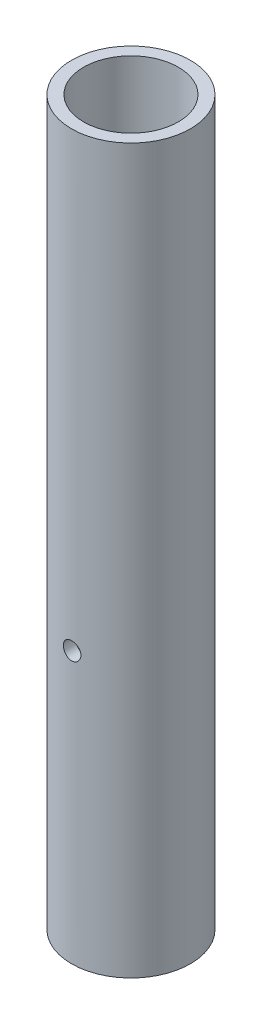
ISO-10303-21;
HEADER;
FILE_DESCRIPTION(('STEP AP214'),'2;1');
FILE_NAME('part.step','',(''),(''),'','','');
FILE_SCHEMA(('AUTOMOTIVE_DESIGN { 1 0 10303 214 1 1 1 1 }'));
ENDSEC;
DATA;
#1=APPLICATION_CONTEXT('core data for automotive mechanical design processes');
#2=APPLICATION_PROTOCOL_DEFINITION('international standard','automotive_design',2000,#1);
#3=PRODUCT_CONTEXT('',#1,'mechanical');
#4=PRODUCT('Part','Part','',(#3));
#5=PRODUCT_RELATED_PRODUCT_CATEGORY('part','',(#4));
#6=PRODUCT_DEFINITION_FORMATION('','',#4);
#7=PRODUCT_DEFINITION_CONTEXT('part definition',#1,'design');
#8=PRODUCT_DEFINITION('design','',#6,#7);
#9=PRODUCT_DEFINITION_SHAPE('','',#8);
#10=(LENGTH_UNIT() NAMED_UNIT(*) SI_UNIT(.MILLI.,.METRE.));
#11=(NAMED_UNIT(*) PLANE_ANGLE_UNIT() SI_UNIT($,.RADIAN.));
#12=(NAMED_UNIT(*) SI_UNIT($,.STERADIAN.) SOLID_ANGLE_UNIT());
#13=UNCERTAINTY_MEASURE_WITH_UNIT(LENGTH_MEASURE(1.E-05),#10,'distance_accuracy_value','');
#14=(GEOMETRIC_REPRESENTATION_CONTEXT(3) GLOBAL_UNCERTAINTY_ASSIGNED_CONTEXT((#13)) GLOBAL_UNIT_ASSIGNED_CONTEXT((#10,
#11,#12)) REPRESENTATION_CONTEXT('',''));
#15=CARTESIAN_POINT('',(0.,0.,0.));
#16=DIRECTION('',(0.,0.,1.));
#17=DIRECTION('',(1.,0.,0.));
#18=AXIS2_PLACEMENT_3D('',#15,#16,#17);
#19=CARTESIAN_POINT('',(0.,203.2,0.));
#20=DIRECTION('',(0.,1.,0.));
#21=DIRECTION('',(0.,0.,1.));
#22=AXIS2_PLACEMENT_3D('',#19,#20,#21);
#23=PLANE('',#22);
#24=CARTESIAN_POINT('',(0.,203.2,0.));
#25=DIRECTION('',(0.,1.,0.));
#26=DIRECTION('',(0.,0.,1.));
#27=AXIS2_PLACEMENT_3D('',#24,#25,#26);
#28=CIRCLE('',#27,16.7005);
#29=CARTESIAN_POINT('',(0.,203.2,16.7005));
#30=VERTEX_POINT('',#29);
#31=EDGE_CURVE('E46',#30,#30,#28,.T.);
#32=ORIENTED_EDGE('',*,*,#31,.T.);
#33=EDGE_LOOP('',(#32));
#34=FACE_BOUND('',#33,.T.);
#35=CARTESIAN_POINT('',(0.,203.2,0.));
#36=DIRECTION('',(0.,1.,0.));
#37=DIRECTION('',(0.,0.,1.));
#38=AXIS2_PLACEMENT_3D('',#35,#36,#37);
#39=CIRCLE('',#38,13.3223);
#40=CARTESIAN_POINT('',(0.,203.2,13.3223));
#41=VERTEX_POINT('',#40);
#42=EDGE_CURVE('E82',#41,#41,#39,.T.);
#43=ORIENTED_EDGE('',*,*,#42,.F.);
#44=EDGE_LOOP('',(#43));
#45=FACE_BOUND('',#44,.T.);
#46=ADVANCED_FACE('F30',(#34,#45),#23,.T.);
#47=CARTESIAN_POINT('',(0.,0.,0.));
#48=DIRECTION('',(0.,1.,0.));
#49=DIRECTION('',(0.,0.,1.));
#50=AXIS2_PLACEMENT_3D('',#47,#48,#49);
#51=PLANE('',#50);
#52=CARTESIAN_POINT('',(0.,0.,0.));
#53=DIRECTION('',(0.,1.,0.));
#54=DIRECTION('',(0.,0.,1.));
#55=AXIS2_PLACEMENT_3D('',#52,#53,#54);
#56=CIRCLE('',#55,16.7005);
#57=CARTESIAN_POINT('',(0.,0.,16.7005));
#58=VERTEX_POINT('',#57);
#59=EDGE_CURVE('E50',#58,#58,#56,.T.);
#60=ORIENTED_EDGE('',*,*,#59,.F.);
#61=EDGE_LOOP('',(#60));
#62=FACE_BOUND('',#61,.T.);
#63=CARTESIAN_POINT('',(0.,0.,0.));
#64=DIRECTION('',(0.,1.,0.));
#65=DIRECTION('',(0.,0.,1.));
#66=AXIS2_PLACEMENT_3D('',#63,#64,#65);
#67=CIRCLE('',#66,13.3223);
#68=CARTESIAN_POINT('',(0.,0.,13.3223));
#69=VERTEX_POINT('',#68);
#70=EDGE_CURVE('E81',#69,#69,#67,.T.);
#71=ORIENTED_EDGE('',*,*,#70,.T.);
#72=EDGE_LOOP('',(#71));
#73=FACE_BOUND('',#72,.T.);
#74=ADVANCED_FACE('F88',(#62,#73),#51,.F.);
#75=CARTESIAN_POINT('',(0.,203.2,0.));
#76=DIRECTION('',(0.,-1.,0.));
#77=DIRECTION('',(0.,0.,-1.));
#78=AXIS2_PLACEMENT_3D('',#75,#76,#77);
#79=CYLINDRICAL_SURFACE('',#78,16.7005);
#80=CARTESIAN_POINT('',(0.,78.65745,-16.7005));
#81=CARTESIAN_POINT('',(-0.137241002586095,78.6574443172632,-16.7004978297723));
#82=CARTESIAN_POINT('',(-0.274562395614258,78.6459144631919,-16.6987905295661));
#83=CARTESIAN_POINT('',(-0.545368954025849,78.6001101597742,-16.692144073684));
#84=CARTESIAN_POINT('',(-0.67885021629541,78.5658133668969,-16.687201743208));
#85=CARTESIAN_POINT('',(-0.938018039695351,78.4755203931146,-16.6746408025099));
#86=CARTESIAN_POINT('',(-1.06371033260249,78.4195403938811,-16.667024188439));
#87=CARTESIAN_POINT('',(-1.30389740425303,78.287509131431,-16.6499569863152));
#88=CARTESIAN_POINT('',(-1.4183937795525,78.2114607357377,-16.640506660328));
#89=CARTESIAN_POINT('',(-1.63382074022937,78.0408410916021,-16.6207438920229));
#90=CARTESIAN_POINT('',(-1.73465481879892,77.9461486019758,-16.6104260745677));
#91=CARTESIAN_POINT('',(-1.91906240748763,77.7411895979179,-16.590133430487));
#92=CARTESIAN_POINT('',(-2.00263493949766,77.6309222015447,-16.5801586233246));
#93=CARTESIAN_POINT('',(-2.15052091577267,77.3972975113157,-16.561629164337));
#94=CARTESIAN_POINT('',(-2.21474133242651,77.2738807317752,-16.5530814577229));
#95=CARTESIAN_POINT('',(-2.32150564940027,77.0178659029884,-16.5384471310881));
#96=CARTESIAN_POINT('',(-2.36405068629374,76.8852683355614,-16.5323603820277));
#97=CARTESIAN_POINT('',(-2.42595757582157,76.615669384149,-16.52338982507));
#98=CARTESIAN_POINT('',(-2.44548439893445,76.4787066534293,-16.520483236049));
#99=CARTESIAN_POINT('',(-2.46131155797085,76.2034199981308,-16.5181328742541));
#100=CARTESIAN_POINT('',(-2.45761317797935,76.0650961492282,-16.518688910037));
#101=CARTESIAN_POINT('',(-2.42722980427084,75.7921771947427,-16.5231801378742));
#102=CARTESIAN_POINT('',(-2.40072829709775,75.6575611543371,-16.5270883556312));
#103=CARTESIAN_POINT('',(-2.32577806296215,75.394707552563,-16.5378014620931));
#104=CARTESIAN_POINT('',(-2.27732873657325,75.2664701655108,-16.5446064299121));
#105=CARTESIAN_POINT('',(-2.15966654400834,75.019454347405,-16.5603761829055));
#106=CARTESIAN_POINT('',(-2.09037571102821,74.9007135919144,-16.5693490528278));
#107=CARTESIAN_POINT('',(-1.93305297324694,74.6764751085356,-16.5884377043361));
#108=CARTESIAN_POINT('',(-1.84501988409833,74.5709782182144,-16.5985535581298));
#109=CARTESIAN_POINT('',(-1.65170319018972,74.3751585159883,-16.6189076510182));
#110=CARTESIAN_POINT('',(-1.54626177954684,74.2849914450624,-16.6291461312805));
#111=CARTESIAN_POINT('',(-1.32166005382029,74.1236095060202,-16.6485014022344));
#112=CARTESIAN_POINT('',(-1.20249968268389,74.0523947153427,-16.6576181883427));
#113=CARTESIAN_POINT('',(-0.95370939895346,73.9309318294017,-16.6737118688301));
#114=CARTESIAN_POINT('',(-0.824073673660535,73.8806954716035,-16.6806875646892));
#115=CARTESIAN_POINT('',(-0.558080419106376,73.8027494217297,-16.6917029860144));
#116=CARTESIAN_POINT('',(-0.421723327610488,73.7750382646293,-16.6957429024199));
#117=CARTESIAN_POINT('',(-0.147502473044598,73.7431356823631,-16.7004063462538));
#118=CARTESIAN_POINT('',(-0.009664134999626,73.7387300929091,-16.7010609811464));
#119=CARTESIAN_POINT('',(0.264783345862588,73.7529956484227,-16.6989646953154));
#120=CARTESIAN_POINT('',(0.401392525136831,73.7716661066641,-16.6962138759356));
#121=CARTESIAN_POINT('',(0.668857209450764,73.8313757006782,-16.687635015049));
#122=CARTESIAN_POINT('',(0.799736445327504,73.8723107697769,-16.6818212937397));
#123=CARTESIAN_POINT('',(1.05277383442949,73.9752780368446,-16.6677665098364));
#124=CARTESIAN_POINT('',(1.1749315912161,74.0373111930986,-16.6595253369887));
#125=CARTESIAN_POINT('',(1.40800196355319,74.1812181108909,-16.6414544710615));
#126=CARTESIAN_POINT('',(1.51882964592307,74.2632280559232,-16.6316140358457));
#127=CARTESIAN_POINT('',(1.72522512469505,74.4445706148625,-16.6114741127572));
#128=CARTESIAN_POINT('',(1.82079206878918,74.5439041956419,-16.6011745992862));
#129=CARTESIAN_POINT('',(1.99473017258971,74.7580265331706,-16.5811790220008));
#130=CARTESIAN_POINT('',(2.07295795995831,74.8729323442112,-16.5714884322264));
#131=CARTESIAN_POINT('',(2.20900133795701,75.1143789935112,-16.5539040271886));
#132=CARTESIAN_POINT('',(2.26681746360813,75.240919526697,-16.5460101648321));
#133=CARTESIAN_POINT('',(2.36017289391032,75.501611777507,-16.5329523514037));
#134=CARTESIAN_POINT('',(2.39578830652267,75.6357357532424,-16.5277790832993));
#135=CARTESIAN_POINT('',(2.44397393140632,75.9081430575069,-16.520723190229));
#136=CARTESIAN_POINT('',(2.45654567008053,76.0464261099238,-16.5188403473072));
#137=CARTESIAN_POINT('',(2.45825178572981,76.3217975487836,-16.5185864139892));
#138=CARTESIAN_POINT('',(2.44761156366051,76.4588845609534,-16.5201815504128));
#139=CARTESIAN_POINT('',(2.40367811516855,76.7292971833747,-16.5266305422418));
#140=CARTESIAN_POINT('',(2.37038491967999,76.8626227987623,-16.5314843931973));
#141=CARTESIAN_POINT('',(2.28216919826038,77.1216695342128,-16.5438922668198));
#142=CARTESIAN_POINT('',(2.22726183282954,77.2473959133437,-16.5514443965317));
#143=CARTESIAN_POINT('',(2.09739874863057,77.4878884088105,-16.5684002872844));
#144=CARTESIAN_POINT('',(2.02244240271702,77.602654182139,-16.5778041062448));
#145=CARTESIAN_POINT('',(1.85378795362931,77.8191138162986,-16.5975126136392));
#146=CARTESIAN_POINT('',(1.75992275602177,77.9206768138982,-16.6078248366426));
#147=CARTESIAN_POINT('',(1.55646806008992,78.1066905461731,-16.628124870636));
#148=CARTESIAN_POINT('',(1.44687490655713,78.1911372919613,-16.6381126055507));
#149=CARTESIAN_POINT('',(1.21439519227234,78.3409183780188,-16.6566984424038));
#150=CARTESIAN_POINT('',(1.09144141773012,78.4061493188647,-16.6652889187958));
#151=CARTESIAN_POINT('',(0.836255925344655,78.5149373896911,-16.6800373518673));
#152=CARTESIAN_POINT('',(0.704034040018824,78.5585171038904,-16.6861978418574));
#153=CARTESIAN_POINT('',(0.476006139049486,78.6128114887158,-16.6939761800684));
#154=CARTESIAN_POINT('',(0.381611705538275,78.6295255386979,-16.6964101284353));
#155=CARTESIAN_POINT('',(0.191491218526871,78.6518467118515,-16.6996727861633));
#156=CARTESIAN_POINT('',(0.0957651806647244,78.6574539653478,-16.7005015143598));
#157=CARTESIAN_POINT('',(0.,78.65745,-16.7005));
#158=B_SPLINE_CURVE_WITH_KNOTS('',3,(#80,#81,#82,#83,#84,#85,#86,#87,#88,#89,#90,#91,#92,#93,
#94,#95,#96,#97,#98,#99,#100,#101,#102,#103,#104,#105,#106,#107,#108,#109,#110,#111,#112,#113,
#114,#115,#116,#117,#118,#119,#120,#121,#122,#123,#124,#125,#126,#127,#128,#129,#130,#131,#132,
#133,#134,#135,#136,#137,#138,#139,#140,#141,#142,#143,#144,#145,#146,#147,#148,#149,#150,#151,
#152,#153,#154,#155,#156,#157),.UNSPECIFIED.,.T.,.F.,(4,2,2,2,2,2,2,2,2,2,2,2,2,2,2,2,2,2,2,2,2,
2,2,2,2,2,2,2,2,2,2,2,2,2,2,2,2,2,4),(0.,0.411373088645843,0.823150497923342,1.2346211975503,
1.64603313495374,2.06021450565259,2.47441933911035,2.89058464983191,3.30672813619844,
3.71987064933668,4.13299032067577,4.54281656225307,4.95265399744673,5.36404409199506,
5.77546019053718,6.19083418843242,6.60620988351655,7.02181767156504,7.43739842658155,
7.84915352273239,8.26089636564904,8.67073102247494,9.08058429666827,9.4933138650361,
9.90606647617899,10.3221142694046,10.7381511565683,11.1527538368046,11.5673290529477,
11.9778964485713,12.3884632835395,12.7987426524888,13.2090348567502,13.6231257305417,
14.0373129961949,14.453689897023,14.8696315618025,15.1566863025583,15.4437376750521),.UNSPECIFIED.);
#159=CARTESIAN_POINT('',(0.,78.65745,-16.7005));
#160=VERTEX_POINT('',#159);
#161=EDGE_CURVE('E10',#160,#160,#158,.T.);
#162=ORIENTED_EDGE('',*,*,#161,.T.);
#163=EDGE_LOOP('',(#162));
#164=FACE_BOUND('',#163,.T.);
#165=CARTESIAN_POINT('',(2.45744999999999,76.2,16.5187057527973));
#166=CARTESIAN_POINT('',(2.45744430947538,76.062768065207,16.5187080124768));
#167=CARTESIAN_POINT('',(2.44591592753167,75.9254557153208,16.5204343683099));
#168=CARTESIAN_POINT('',(2.40011800219898,75.6546679423922,16.5271488430371));
#169=CARTESIAN_POINT('',(2.36582608264375,75.5211964296518,16.5321401712723));
#170=CARTESIAN_POINT('',(2.27554736128846,75.2620492342262,16.5448072932925));
#171=CARTESIAN_POINT('',(2.21957697168816,75.1363677372259,16.5524810558495));
#172=CARTESIAN_POINT('',(2.08756834832131,74.896198799838,16.5696459924043));
#173=CARTESIAN_POINT('',(2.01153295899234,74.7817097759427,16.5791369087479));
#174=CARTESIAN_POINT('',(1.84092653118596,74.5662746998509,16.5989485835532));
#175=CARTESIAN_POINT('',(1.74623133894961,74.4654274393283,16.6092746111797));
#176=CARTESIAN_POINT('',(1.54126137022878,74.280994356058,16.6295459560066));
#177=CARTESIAN_POINT('',(1.43098574802961,74.1974094709287,16.6394912525033));
#178=CARTESIAN_POINT('',(1.19735366640818,74.0495104287176,16.6579355702648));
#179=CARTESIAN_POINT('',(1.07393913659658,73.9852870709957,16.6664276986491));
#180=CARTESIAN_POINT('',(0.8179291910633,73.8785166985645,16.6809505376801));
#181=CARTESIAN_POINT('',(0.685334242953888,73.8359685807299,16.6869813735871));
#182=CARTESIAN_POINT('',(0.415744063703231,73.7740554715486,16.6958649496773));
#183=CARTESIAN_POINT('',(0.278787556374286,73.7545251666068,16.6987403417938));
#184=CARTESIAN_POINT('',(0.0035131420926732,73.7386888867826,16.7010666534024));
#185=CARTESIAN_POINT('',(-0.134804691498321,73.7423816671798,16.700517756431));
#186=CARTESIAN_POINT('',(-0.407747939312379,73.7727560260571,16.6960754624465));
#187=CARTESIAN_POINT('',(-0.542393625632525,73.7992597607219,16.6922079395415));
#188=CARTESIAN_POINT('',(-0.805305363194196,73.874224667994,16.6815917907607));
#189=CARTESIAN_POINT('',(-0.933571255207159,73.9226863883295,16.674843093016));
#190=CARTESIAN_POINT('',(-1.18062220480177,74.0403745452532,16.6591783766539));
#191=CARTESIAN_POINT('',(-1.29937095881405,74.1096761072453,16.6502545393189));
#192=CARTESIAN_POINT('',(-1.52362091941888,74.2670219073512,16.6312345779741));
#193=CARTESIAN_POINT('',(-1.62912128569252,74.3550673333973,16.6211383796819));
#194=CARTESIAN_POINT('',(-1.82492761426419,74.5483929684794,16.6007873388225));
#195=CARTESIAN_POINT('',(-1.91508030907855,74.6538284180485,16.5905318991695));
#196=CARTESIAN_POINT('',(-2.07643605550831,74.8784130284403,16.5711115782907));
#197=CARTESIAN_POINT('',(-2.14763899860403,74.9975622677923,16.5619467033102));
#198=CARTESIAN_POINT('',(-2.26909328064757,75.246349146112,16.5457454089952));
#199=CARTESIAN_POINT('',(-2.31932929421873,75.3759943745708,16.5387105475809));
#200=CARTESIAN_POINT('',(-2.39727176166737,75.6420083425018,16.5275936836832));
#201=CARTESIAN_POINT('',(-2.42497974063722,75.7783766261766,16.5235114813142));
#202=CARTESIAN_POINT('',(-2.45687030013662,76.0526032968459,16.5187998955576));
#203=CARTESIAN_POINT('',(-2.46126995379079,76.1904359116762,16.5181386537319));
#204=CARTESIAN_POINT('',(-2.44699456926314,76.4648705351414,16.5202593161451));
#205=CARTESIAN_POINT('',(-2.42832021918715,76.6014725803515,16.5230411177067));
#206=CARTESIAN_POINT('',(-2.36861086911343,76.8688986443416,16.5317051870516));
#207=CARTESIAN_POINT('',(-2.32768364219478,76.9997472526563,16.5375725068809));
#208=CARTESIAN_POINT('',(-2.22474227600402,77.2527268415027,16.5517342141971));
#209=CARTESIAN_POINT('',(-2.16272713152496,77.3748574061316,16.560028717379));
#210=CARTESIAN_POINT('',(-2.01884727498378,77.6079082578104,16.5781854238803));
#211=CARTESIAN_POINT('',(-1.93684181916694,77.7187407864233,16.5880585642301));
#212=CARTESIAN_POINT('',(-1.75550523252819,77.9251481235191,16.608226984883));
#213=CARTESIAN_POINT('',(-1.65617316005409,78.0207221022022,16.618522288106));
#214=CARTESIAN_POINT('',(-1.44204796963764,78.1946768310527,16.6384743773765));
#215=CARTESIAN_POINT('',(-1.32713748551731,78.2729138713268,16.6481253943565));
#216=CARTESIAN_POINT('',(-1.08567888604736,78.4089734657242,16.6656122849292));
#217=CARTESIAN_POINT('',(-0.959131079345495,78.4667965610742,16.673448206643));
#218=CARTESIAN_POINT('',(-0.698442271417828,78.5601563078468,16.6863966957282));
#219=CARTESIAN_POINT('',(-0.564330106149467,78.5957720819693,16.69151892183));
#220=CARTESIAN_POINT('',(-0.291947825689106,78.6439624266361,16.6985033768461));
#221=CARTESIAN_POINT('',(-0.153677974891229,78.6565384591796,16.7003658126118));
#222=CARTESIAN_POINT('',(0.121699743808391,78.6582576788393,16.7006189038829));
#223=CARTESIAN_POINT('',(0.258806258650909,78.6476209585839,16.6990421681015));
#224=CARTESIAN_POINT('',(0.529258792296391,78.6036876778028,16.6926597123991));
#225=CARTESIAN_POINT('',(0.662604821824158,78.5703911819091,16.6878540016879));
#226=CARTESIAN_POINT('',(0.921694576858051,78.4821605299577,16.6755510463987));
#227=CARTESIAN_POINT('',(1.04744339077209,78.4272410459332,16.6680556271967));
#228=CARTESIAN_POINT('',(1.28797574029564,78.2973467370088,16.6511973429799));
#229=CARTESIAN_POINT('',(1.4027589468411,78.2223713105116,16.6418344219496));
#230=CARTESIAN_POINT('',(1.6192192292109,78.0536951793272,16.6221769146605));
#231=CARTESIAN_POINT('',(1.72076884844073,77.9598317865806,16.6118746915543));
#232=CARTESIAN_POINT('',(1.90675642754568,77.7563862976557,16.5915567784652));
#233=CARTESIAN_POINT('',(1.99119036263164,77.6468005146464,16.5815411563515));
#234=CARTESIAN_POINT('',(2.14095683172924,77.4143274766375,16.5628725648814));
#235=CARTESIAN_POINT('',(2.20618387361259,77.2913716603805,16.5542272372679));
#236=CARTESIAN_POINT('',(2.31496409858167,77.0361819929638,16.5393676407988));
#237=CARTESIAN_POINT('',(2.35853990791791,76.9039579930042,16.5331508355165));
#238=CARTESIAN_POINT('',(2.41282389179991,76.675940402222,16.5252975621668));
#239=CARTESIAN_POINT('',(2.42953326993821,76.5815591153394,16.5228386404219));
#240=CARTESIAN_POINT('',(2.45184824145221,76.3914649245251,16.5195419573083));
#241=CARTESIAN_POINT('',(2.45745397049944,76.2957520368782,16.5187041761315));
#242=CARTESIAN_POINT('',(2.45744999999999,76.2,16.5187057527973));
#243=B_SPLINE_CURVE_WITH_KNOTS('',3,(#165,#166,#167,#168,#169,#170,#171,#172,#173,#174,#175,
#176,#177,#178,#179,#180,#181,#182,#183,#184,#185,#186,#187,#188,#189,#190,#191,#192,#193,#194,
#195,#196,#197,#198,#199,#200,#201,#202,#203,#204,#205,#206,#207,#208,#209,#210,#211,#212,#213,
#214,#215,#216,#217,#218,#219,#220,#221,#222,#223,#224,#225,#226,#227,#228,#229,#230,#231,#232,
#233,#234,#235,#236,#237,#238,#239,#240,#241,#242),.UNSPECIFIED.,.T.,.F.,(4,2,2,2,2,2,2,2,2,2,2,
2,2,2,2,2,2,2,2,2,2,2,2,2,2,2,2,2,2,2,2,2,2,2,2,2,2,2,4),(0.,0.411345843808979,
0.823096633457797,1.2345363048081,1.64591768129818,2.06013471509655,2.47437424147744,
2.89052723468406,3.30665904636239,3.71978363186355,4.13288607473274,4.54279667418323,
4.95271749916048,5.36413412988716,5.77557684278684,6.1909138865837,6.60625330884288,
7.02189578609633,7.43751012303635,7.84924690273879,8.26097140405036,8.67071941399361,
9.08048695831191,9.49322735125619,9.90599018245609,10.3220561597629,10.7381111052526,
11.1526750843307,11.5672127561193,11.977837062485,12.3884601976429,12.798805187989,
13.2091624884052,13.6232185208852,14.0373718068525,14.4537590883261,14.8697103113417,
15.1567257478912,15.4437376774797),.UNSPECIFIED.);
#244=CARTESIAN_POINT('',(2.45744999999999,76.2,16.5187057527973));
#245=VERTEX_POINT('',#244);
#246=EDGE_CURVE('E42',#245,#245,#243,.T.);
#247=ORIENTED_EDGE('',*,*,#246,.T.);
#248=EDGE_LOOP('',(#247));
#249=FACE_BOUND('',#248,.T.);
#250=ORIENTED_EDGE('',*,*,#31,.F.);
#251=EDGE_LOOP('',(#250));
#252=FACE_BOUND('',#251,.T.);
#253=ORIENTED_EDGE('',*,*,#59,.T.);
#254=EDGE_LOOP('',(#253));
#255=FACE_BOUND('',#254,.T.);
#256=ADVANCED_FACE('F32',(#164,#249,#252,#255),#79,.T.);
#257=CARTESIAN_POINT('',(0.,203.2,0.));
#258=DIRECTION('',(0.,-1.,0.));
#259=DIRECTION('',(0.,0.,-1.));
#260=AXIS2_PLACEMENT_3D('',#257,#258,#259);
#261=CYLINDRICAL_SURFACE('',#260,13.3223);
#262=CARTESIAN_POINT('',(0.,78.65745,-13.3223));
#263=CARTESIAN_POINT('',(-0.136792522009882,78.6574447304359,-13.3222975377349));
#264=CARTESIAN_POINT('',(-0.273654074854263,78.6459896909708,-13.3201713519274));
#265=CARTESIAN_POINT('',(-0.543523269970786,78.6005000944315,-13.3118944790324));
#266=CARTESIAN_POINT('',(-0.676527513397432,78.5664462198103,-13.3057403489087));
#267=CARTESIAN_POINT('',(-0.934739924217858,78.4768348697384,-13.2900962878083));
#268=CARTESIAN_POINT('',(-1.05995491682422,78.4212965368099,-13.2806093270526));
#269=CARTESIAN_POINT('',(-1.29927721137958,78.2903465113233,-13.2593366586175));
#270=CARTESIAN_POINT('',(-1.41338546747174,78.2149365279403,-13.2475511486605));
#271=CARTESIAN_POINT('',(-1.62859191929645,78.0454543292284,-13.2228301171818));
#272=CARTESIAN_POINT('',(-1.72954253393135,77.9511962557931,-13.2098839141125));
#273=CARTESIAN_POINT('',(-1.91429164872613,77.7470933705943,-13.1843802662761));
#274=CARTESIAN_POINT('',(-1.99808894068115,77.6372474618142,-13.1718228489462));
#275=CARTESIAN_POINT('',(-2.14676315326968,77.4040484684567,-13.1484148194987));
#276=CARTESIAN_POINT('',(-2.2114905825346,77.2805985723093,-13.1375779849045));
#277=CARTESIAN_POINT('',(-2.31923087025164,77.0243437176195,-13.1189882853121));
#278=CARTESIAN_POINT('',(-2.36224553843881,76.891539539798,-13.1112351633011));
#279=CARTESIAN_POINT('',(-2.42486693858493,76.6219228896804,-13.0997980706226));
#280=CARTESIAN_POINT('',(-2.44473066383543,76.4851720377525,-13.0960694597995));
#281=CARTESIAN_POINT('',(-2.46128387949823,76.2102316033228,-13.0929689058861));
#282=CARTESIAN_POINT('',(-2.45797538053602,76.0720421466858,-13.093596584806));
#283=CARTESIAN_POINT('',(-2.42848659548994,75.8000048691329,-13.0990970298634));
#284=CARTESIAN_POINT('',(-2.40259799561372,75.6661241734761,-13.1039156557702));
#285=CARTESIAN_POINT('',(-2.32914300738034,75.4046395455028,-13.1171700630236));
#286=CARTESIAN_POINT('',(-2.28157572476229,75.2770358723585,-13.1256059935857));
#287=CARTESIAN_POINT('',(-2.16582678284663,75.030871016552,-13.1452013789581));
#288=CARTESIAN_POINT('',(-2.09752683543276,74.9123667433671,-13.156376388944));
#289=CARTESIAN_POINT('',(-1.94233505428968,74.6883908729295,-13.1801804300322));
#290=CARTESIAN_POINT('',(-1.85544139242514,74.5829205587862,-13.1928096040516));
#291=CARTESIAN_POINT('',(-1.66395358936182,74.3863207474694,-13.2183351950785));
#292=CARTESIAN_POINT('',(-1.55910983866294,74.2954343425107,-13.2312327513666));
#293=CARTESIAN_POINT('',(-1.33553458988714,74.1325037694684,-13.2556648170149));
#294=CARTESIAN_POINT('',(-1.21680296094366,74.060459778959,-13.2671993135288));
#295=CARTESIAN_POINT('',(-0.968572564077005,73.9372253930183,-13.2876277985242));
#296=CARTESIAN_POINT('',(-0.83906126003754,73.8860596975536,-13.2965186561086));
#297=CARTESIAN_POINT('',(-0.573081830372026,73.8062769857724,-13.3106337856521));
#298=CARTESIAN_POINT('',(-0.436614421174321,73.7776576523202,-13.3158584343888));
#299=CARTESIAN_POINT('',(-0.162688578237056,73.7441170720116,-13.3220008827736));
#300=CARTESIAN_POINT('',(-0.0252722522780297,73.7388626550834,-13.3229792273783));
#301=CARTESIAN_POINT('',(0.248475681139137,73.7513081992646,-13.3206858618975));
#302=CARTESIAN_POINT('',(0.384807339800255,73.7690070702909,-13.3174143536432));
#303=CARTESIAN_POINT('',(0.651463440249678,73.826579760905,-13.3070265389115));
#304=CARTESIAN_POINT('',(0.781825394658761,73.8662855518791,-13.2999393775406));
#305=CARTESIAN_POINT('',(1.03404211300809,73.9665635632657,-13.282711625697));
#306=CARTESIAN_POINT('',(1.1558963133024,74.0271371646137,-13.2725708331546));
#307=CARTESIAN_POINT('',(1.3890643002495,74.1681726489983,-13.2502096870459));
#308=CARTESIAN_POINT('',(1.50025248026736,74.2488388064061,-13.2379684030302));
#309=CARTESIAN_POINT('',(1.70763362816101,74.4274924749874,-13.2128194091537));
#310=CARTESIAN_POINT('',(1.80382524244045,74.525481548033,-13.1999116392754));
#311=CARTESIAN_POINT('',(1.97974401645314,74.7375057509814,-13.1746843694326));
#312=CARTESIAN_POINT('',(2.0592441416751,74.851730594448,-13.1623745398384));
#313=CARTESIAN_POINT('',(2.19792862091012,75.0921093782575,-13.1399293373154));
#314=CARTESIAN_POINT('',(2.25711371467014,75.2182628840192,-13.1297938852144));
#315=CARTESIAN_POINT('',(2.35316347696199,75.4783326760362,-13.1129204041514));
#316=CARTESIAN_POINT('',(2.39013356615,75.6122089402717,-13.1061663547498));
#317=CARTESIAN_POINT('',(2.44103008978801,75.8844086708485,-13.0967832300155));
#318=CARTESIAN_POINT('',(2.45495903112932,76.0227316517147,-13.0941537059335));
#319=CARTESIAN_POINT('',(2.45929609540872,76.2976253300505,-13.0933396029172));
#320=CARTESIAN_POINT('',(2.45006221429093,76.4341903078455,-13.09508736955));
#321=CARTESIAN_POINT('',(2.40911804692803,76.7037861138592,-13.1026811688482));
#322=CARTESIAN_POINT('',(2.37740788482668,76.8368169615937,-13.1085271788775));
#323=CARTESIAN_POINT('',(2.29256026272494,77.0953839252639,-13.1236306950268));
#324=CARTESIAN_POINT('',(2.23946036205797,77.220932737971,-13.1328822187898));
#325=CARTESIAN_POINT('',(2.11337932854215,77.4613969135937,-13.1537587953946));
#326=CARTESIAN_POINT('',(2.04039685378231,77.5763115580886,-13.1653840084278));
#327=CARTESIAN_POINT('',(1.8753726950871,77.7940410659864,-13.1899087974182));
#328=CARTESIAN_POINT('',(1.78307002340381,77.8966563456413,-13.2028244059864));
#329=CARTESIAN_POINT('',(1.58257089731807,78.0850615666474,-13.2283535916587));
#330=CARTESIAN_POINT('',(1.47437079548734,78.1708476362112,-13.2409670986756));
#331=CARTESIAN_POINT('',(1.24402519334731,78.3238521994475,-13.2645989806582));
#332=CARTESIAN_POINT('',(1.12176689918823,78.3909032296815,-13.2756025746004));
#333=CARTESIAN_POINT('',(0.867558609674203,78.5034071828407,-13.2946306443154));
#334=CARTESIAN_POINT('',(0.735617939974556,78.5488805811971,-13.3026579427642));
#335=CARTESIAN_POINT('',(0.502724509325839,78.6076071792298,-13.3131746315743));
#336=CARTESIAN_POINT('',(0.403141016174936,78.6262666060967,-13.3165774792792));
#337=CARTESIAN_POINT('',(0.202384253078359,78.6511898169094,-13.3211410474375));
#338=CARTESIAN_POINT('',(0.101211021414482,78.6574538988824,-13.3223018217982));
#339=CARTESIAN_POINT('',(0.,78.65745,-13.3223));
#340=B_SPLINE_CURVE_WITH_KNOTS('',3,(#262,#263,#264,#265,#266,#267,#268,#269,#270,#271,#272,
#273,#274,#275,#276,#277,#278,#279,#280,#281,#282,#283,#284,#285,#286,#287,#288,#289,#290,#291,
#292,#293,#294,#295,#296,#297,#298,#299,#300,#301,#302,#303,#304,#305,#306,#307,#308,#309,#310,
#311,#312,#313,#314,#315,#316,#317,#318,#319,#320,#321,#322,#323,#324,#325,#326,#327,#328,#329,
#330,#331,#332,#333,#334,#335,#336,#337,#338,#339),.UNSPECIFIED.,.T.,.F.,(4,2,2,2,2,2,2,2,2,2,2,
2,2,2,2,2,2,2,2,2,2,2,2,2,2,2,2,2,2,2,2,2,2,2,2,2,2,2,4),(0.,0.410007458868857,
0.820365845476644,1.23035944426705,1.64031779071352,2.05453795894284,2.46878729299367,
2.88620248687048,3.30358288389685,3.71628452615578,4.12895035924296,4.53636309638743,
4.94379264111481,5.35359187539376,5.76343141969065,6.17951789638134,6.59560829420312,
7.01218952848594,7.42872794427674,7.83930731552823,8.24986718851456,8.65733467283295,
9.06482912665294,9.47664881837824,9.8885056596298,10.3056457880137,10.7227707251396,
11.1379002460378,11.552984597613,11.9616932099957,12.3703995649663,12.7783913584128,
13.1864106947902,13.6003456801166,14.0143757853872,14.4319962358739,14.8492196018206,
15.152586122628,15.4559453493603),.UNSPECIFIED.);
#341=CARTESIAN_POINT('',(0.,78.65745,-13.3223));
#342=VERTEX_POINT('',#341);
#343=EDGE_CURVE('E75',#342,#342,#340,.T.);
#344=ORIENTED_EDGE('',*,*,#343,.F.);
#345=EDGE_LOOP('',(#344));
#346=FACE_BOUND('',#345,.T.);
#347=CARTESIAN_POINT('',(2.45744999999999,76.2,13.0936861420877));
#348=CARTESIAN_POINT('',(2.45744471252434,76.0632297960912,13.0936887672546));
#349=CARTESIAN_POINT('',(2.44599328427187,75.9263905107073,13.0958523573145));
#350=CARTESIAN_POINT('',(2.40051933167719,75.6565675583931,13.1042626154936));
#351=CARTESIAN_POINT('',(2.3664774055196,75.5235873083454,13.1105127933047));
#352=CARTESIAN_POINT('',(2.2769009910449,75.26542569627,13.1263648077343));
#353=CARTESIAN_POINT('',(2.22138620773851,75.1402373058031,13.1359635706647));
#354=CARTESIAN_POINT('',(2.09049168504527,74.9009598098935,13.157427580033));
#355=CARTESIAN_POINT('',(2.01511359976581,74.7868697813225,13.1692926377235));
#356=CARTESIAN_POINT('',(1.84566401533298,74.5716436824169,13.1941120318759));
#357=CARTESIAN_POINT('',(1.75139950037932,74.4706607491408,13.2070767446556));
#358=CARTESIAN_POINT('',(1.54727004057183,74.2858489915344,13.2325429278505));
#359=CARTESIAN_POINT('',(1.43740408801612,74.2020212761195,13.2450443682769));
#360=CARTESIAN_POINT('',(1.20418660724734,74.053314492177,13.2682863953551));
#361=CARTESIAN_POINT('',(1.08074171485452,73.9885795315988,13.2790133348074));
#362=CARTESIAN_POINT('',(0.824497697193044,73.8808239521103,13.2973816793837));
#363=CARTESIAN_POINT('',(0.691699317198732,73.8378016053911,13.3050233300139));
#364=CARTESIAN_POINT('',(0.422104225575674,73.775165270204,13.3162868055684));
#365=CARTESIAN_POINT('',(0.285369345318011,73.755293245118,13.3199529099806));
#366=CARTESIAN_POINT('',(0.0104604652401703,73.7387178908815,13.3230047690107));
#367=CARTESIAN_POINT('',(-0.127713414869855,73.7420126496225,13.3223908768851));
#368=CARTESIAN_POINT('',(-0.399809270845894,73.7714789307684,13.3169865833624));
#369=CARTESIAN_POINT('',(-0.533762485518052,73.7973726342147,13.3122469039601));
#370=CARTESIAN_POINT('',(-0.795389484029507,73.870862678905,13.2991804197451));
#371=CARTESIAN_POINT('',(-0.923063044322689,73.9184597921389,13.2908534873346));
#372=CARTESIAN_POINT('',(-1.1693155013742,74.0342719900243,13.2714630873877));
#373=CARTESIAN_POINT('',(-1.28784071433236,74.1025986527795,13.2603848709384));
#374=CARTESIAN_POINT('',(-1.51184729011758,74.2578482669273,13.2367179187401));
#375=CARTESIAN_POINT('',(-1.61732736591805,74.344773050895,13.2241290341905));
#376=CARTESIAN_POINT('',(-1.81389485837104,74.5362839135592,13.1986154467347));
#377=CARTESIAN_POINT('',(-1.90474537324406,74.6411130162198,13.1856885328632));
#378=CARTESIAN_POINT('',(-2.06761037583714,74.8646458375138,13.1611347856149));
#379=CARTESIAN_POINT('',(-2.13962460516659,74.9833497464455,13.1495079700736));
#380=CARTESIAN_POINT('',(-2.26283712317003,75.2315706712845,13.128867930336));
#381=CARTESIAN_POINT('',(-2.31400189002775,75.3611047001215,13.1198589216751));
#382=CARTESIAN_POINT('',(-2.39377587592734,75.6271338053473,13.1055397922776));
#383=CARTESIAN_POINT('',(-2.4223875622629,75.7636281185452,13.1002292669365));
#384=CARTESIAN_POINT('',(-2.45589920708583,76.03756950657,13.0939881733707));
#385=CARTESIAN_POINT('',(-2.4611391154879,76.174973606694,13.0929948160711));
#386=CARTESIAN_POINT('',(-2.44866892085441,76.4486936828675,13.0953326269195));
#387=CARTESIAN_POINT('',(-2.43095991434569,76.5850097105934,13.0986635884464));
#388=CARTESIAN_POINT('',(-2.37338612322502,76.8515723144871,13.1092163062837));
#389=CARTESIAN_POINT('',(-2.33369875898547,76.9818585555655,13.1164068916561));
#390=CARTESIAN_POINT('',(-2.23348274720015,77.2339319334627,13.1338419123215));
#391=CARTESIAN_POINT('',(-2.1729526068234,77.3557184607511,13.1440865663503));
#392=CARTESIAN_POINT('',(-2.03198381992083,77.5888353237273,13.1666188406392));
#393=CARTESIAN_POINT('',(-1.95132994822475,77.7000333848662,13.1789280416655));
#394=CARTESIAN_POINT('',(-1.77269417475255,77.9074401289782,13.2041414063031));
#395=CARTESIAN_POINT('',(-1.67471076727976,78.0036475081014,13.2170456215408));
#396=CARTESIAN_POINT('',(-1.46268083746193,78.179607568402,13.2421963248911));
#397=CARTESIAN_POINT('',(-1.34844335980591,78.2591319089785,13.2544321775262));
#398=CARTESIAN_POINT('',(-1.10803215252847,78.3978588201037,13.2766898723325));
#399=CARTESIAN_POINT('',(-0.981858872190086,78.4570621551802,13.2867117977921));
#400=CARTESIAN_POINT('',(-0.721795772523839,78.5531225904554,13.3033666265844));
#401=CARTESIAN_POINT('',(-0.587948932453073,78.5900929446892,13.3100166784446));
#402=CARTESIAN_POINT('',(-0.315811841761479,78.6409999413843,13.3192515358214));
#403=CARTESIAN_POINT('',(-0.177522044443162,78.6549389261117,13.3218367547259));
#404=CARTESIAN_POINT('',(0.0973835159910762,78.6593081132212,13.3226428054376));
#405=CARTESIAN_POINT('',(0.233993724237446,78.6500835698658,13.3209277339872));
#406=CARTESIAN_POINT('',(0.503682467166587,78.6091422786255,13.3134587428458));
#407=CARTESIAN_POINT('',(0.636761033379119,78.5774257316147,13.307704859225));
#408=CARTESIAN_POINT('',(0.895434086873298,78.4925443074303,13.2928042950896));
#409=CARTESIAN_POINT('',(1.02104061138496,78.4394150618075,13.2836632529633));
#410=CARTESIAN_POINT('',(1.26160816844099,78.3132572849704,13.2629791659244));
#411=CARTESIAN_POINT('',(1.37656851802859,78.2402274783097,13.2514359670664));
#412=CARTESIAN_POINT('',(1.59430382991215,78.0751477336238,13.2270199814985));
#413=CARTESIAN_POINT('',(1.69688747197692,77.9828478221067,13.2141309613692));
#414=CARTESIAN_POINT('',(1.88523014120304,77.7823676859829,13.1885799330987));
#415=CARTESIAN_POINT('',(1.97098521006785,77.6741837356821,13.1759179790012));
#416=CARTESIAN_POINT('',(2.12395207824221,77.4438545609578,13.152131674541));
#417=CARTESIAN_POINT('',(2.19099188758796,77.3215935531825,13.1410220260539));
#418=CARTESIAN_POINT('',(2.30347413620686,77.0673803595972,13.1217745551405));
#419=CARTESIAN_POINT('',(2.34893714531567,76.9354375429048,13.1136339039981));
#420=CARTESIAN_POINT('',(2.40763780587105,76.7025710248895,13.1029602441422));
#421=CARTESIAN_POINT('',(2.42628568362997,76.6030183102551,13.0995029040094));
#422=CARTESIAN_POINT('',(2.45119357741079,76.4023229721202,13.0948649111901));
#423=CARTESIAN_POINT('',(2.45745391158914,76.3011803895205,13.0936842000316));
#424=CARTESIAN_POINT('',(2.45744999999999,76.2,13.0936861420877));
#425=B_SPLINE_CURVE_WITH_KNOTS('',3,(#347,#348,#349,#350,#351,#352,#353,#354,#355,#356,#357,
#358,#359,#360,#361,#362,#363,#364,#365,#366,#367,#368,#369,#370,#371,#372,#373,#374,#375,#376,
#377,#378,#379,#380,#381,#382,#383,#384,#385,#386,#387,#388,#389,#390,#391,#392,#393,#394,#395,
#396,#397,#398,#399,#400,#401,#402,#403,#404,#405,#406,#407,#408,#409,#410,#411,#412,#413,#414,
#415,#416,#417,#418,#419,#420,#421,#422,#423,#424),.UNSPECIFIED.,.T.,.F.,(4,2,2,2,2,2,2,2,2,2,2,
2,2,2,2,2,2,2,2,2,2,2,2,2,2,2,2,2,2,2,2,2,2,2,2,2,2,2,4),(0.,0.409940383750404,
0.820233300638077,1.23015059363424,1.64003376173683,2.05434172331787,2.46867645736603,
2.88606285047641,3.30341602429407,3.71607141568046,4.12869274827789,4.53631187728459,
4.94394550642356,5.35381339342301,5.76372168557575,6.17971501218937,6.59571404497744,
7.01237930782755,7.42899898141521,7.83953860193549,8.25005860710081,8.65731200174907,
9.06459457134919,9.47643525488954,9.88831173927719,10.3055028468106,10.7226782568362,
11.1377101813832,11.5526998950208,11.9615409783308,12.3703784103646,12.778538311802,
13.1867243787635,13.6005771152374,14.0145270788208,14.4321645425571,14.8494030557348,
15.1526781249049,15.4559454047847),.UNSPECIFIED.);
#426=CARTESIAN_POINT('',(2.45744999999999,76.2,13.0936861420877));
#427=VERTEX_POINT('',#426);
#428=EDGE_CURVE('E70',#427,#427,#425,.T.);
#429=ORIENTED_EDGE('',*,*,#428,.F.);
#430=EDGE_LOOP('',(#429));
#431=FACE_BOUND('',#430,.T.);
#432=ORIENTED_EDGE('',*,*,#42,.T.);
#433=EDGE_LOOP('',(#432));
#434=FACE_BOUND('',#433,.T.);
#435=ORIENTED_EDGE('',*,*,#70,.F.);
#436=EDGE_LOOP('',(#435));
#437=FACE_BOUND('',#436,.T.);
#438=ADVANCED_FACE('F62',(#346,#431,#434,#437),#261,.F.);
#439=CARTESIAN_POINT('',(0.,76.2,16.7005));
#440=DIRECTION('',(0.,0.,1.));
#441=DIRECTION('',(1.,0.,0.));
#442=AXIS2_PLACEMENT_3D('',#439,#440,#441);
#443=CYLINDRICAL_SURFACE('',#442,2.45744999999999);
#444=ORIENTED_EDGE('',*,*,#428,.T.);
#445=EDGE_LOOP('',(#444));
#446=FACE_BOUND('',#445,.T.);
#447=ORIENTED_EDGE('',*,*,#246,.F.);
#448=EDGE_LOOP('',(#447));
#449=FACE_BOUND('',#448,.T.);
#450=ADVANCED_FACE('F60',(#446,#449),#443,.F.);
#451=ORIENTED_EDGE('',*,*,#343,.T.);
#452=EDGE_LOOP('',(#451));
#453=FACE_BOUND('',#452,.T.);
#454=ORIENTED_EDGE('',*,*,#161,.F.);
#455=EDGE_LOOP('',(#454));
#456=FACE_BOUND('',#455,.T.);
#457=ADVANCED_FACE('F56',(#453,#456),#443,.F.);
#458=CLOSED_SHELL('',(#46,#74,#256,#438,#450,#457));
#459=MANIFOLD_SOLID_BREP('B2',#458);
#460=ADVANCED_BREP_SHAPE_REPRESENTATION('',(#18,#459),#14);
#461=SHAPE_DEFINITION_REPRESENTATION(#9,#460);
ENDSEC;
END-ISO-10303-21;
